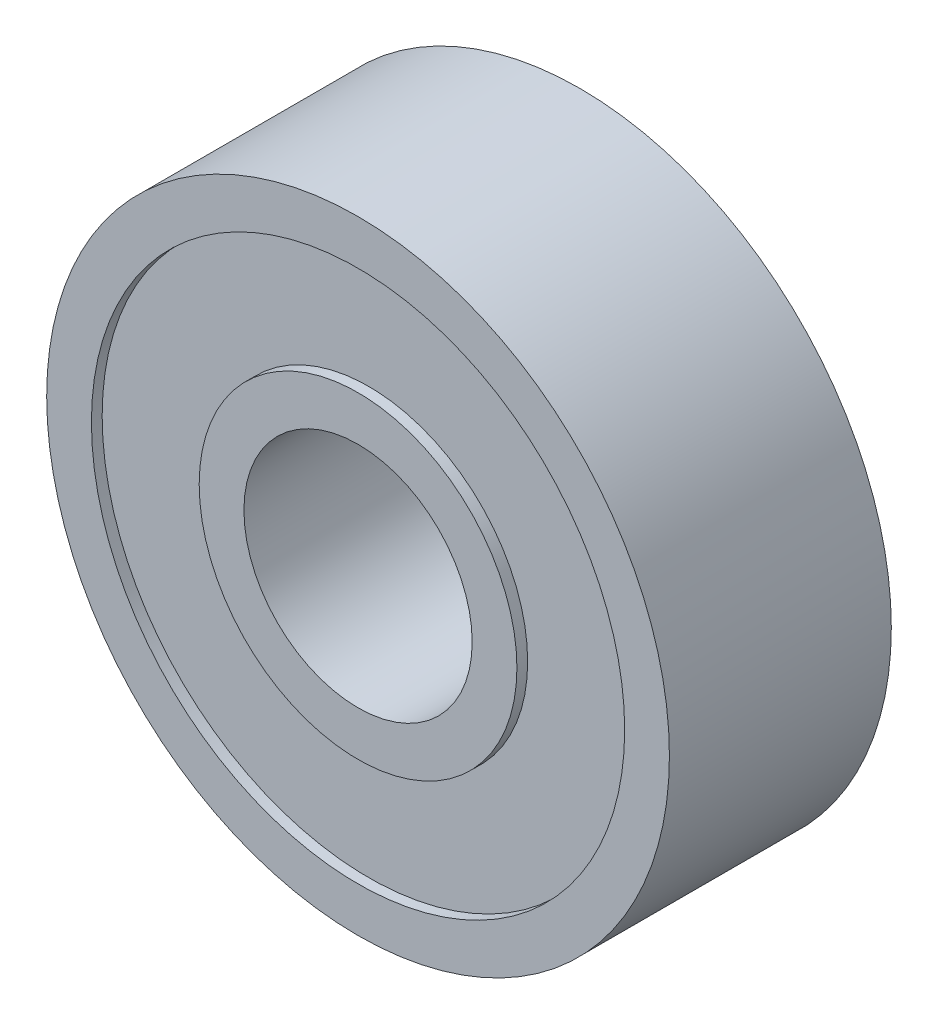
ISO-10303-21;
HEADER;
FILE_DESCRIPTION(('STEP AP214'),'2;1');
FILE_NAME('part.step','',(''),(''),'','','');
FILE_SCHEMA(('AUTOMOTIVE_DESIGN { 1 0 10303 214 1 1 1 1 }'));
ENDSEC;
DATA;
#1=APPLICATION_CONTEXT('core data for automotive mechanical design processes');
#2=APPLICATION_PROTOCOL_DEFINITION('international standard','automotive_design',2000,#1);
#3=PRODUCT_CONTEXT('',#1,'mechanical');
#4=PRODUCT('Part','Part','',(#3));
#5=PRODUCT_RELATED_PRODUCT_CATEGORY('part','',(#4));
#6=PRODUCT_DEFINITION_FORMATION('','',#4);
#7=PRODUCT_DEFINITION_CONTEXT('part definition',#1,'design');
#8=PRODUCT_DEFINITION('design','',#6,#7);
#9=PRODUCT_DEFINITION_SHAPE('','',#8);
#10=(LENGTH_UNIT() NAMED_UNIT(*) SI_UNIT(.MILLI.,.METRE.));
#11=(NAMED_UNIT(*) PLANE_ANGLE_UNIT() SI_UNIT($,.RADIAN.));
#12=(NAMED_UNIT(*) SI_UNIT($,.STERADIAN.) SOLID_ANGLE_UNIT());
#13=UNCERTAINTY_MEASURE_WITH_UNIT(LENGTH_MEASURE(1.E-05),#10,'distance_accuracy_value','');
#14=(GEOMETRIC_REPRESENTATION_CONTEXT(3) GLOBAL_UNCERTAINTY_ASSIGNED_CONTEXT((#13)) GLOBAL_UNIT_ASSIGNED_CONTEXT((#10,
#11,#12)) REPRESENTATION_CONTEXT('',''));
#15=CARTESIAN_POINT('',(0.,0.,0.));
#16=DIRECTION('',(0.,0.,1.));
#17=DIRECTION('',(1.,0.,0.));
#18=AXIS2_PLACEMENT_3D('',#15,#16,#17);
#19=CARTESIAN_POINT('',(0.,0.,-3.937));
#20=DIRECTION('',(0.,0.,1.));
#21=DIRECTION('',(1.,0.,0.));
#22=AXIS2_PLACEMENT_3D('',#19,#20,#21);
#23=PLANE('',#22);
#24=CARTESIAN_POINT('',(0.,0.,-3.937));
#25=DIRECTION('',(0.,0.,1.));
#26=DIRECTION('',(1.,0.,0.));
#27=AXIS2_PLACEMENT_3D('',#24,#25,#26);
#28=CIRCLE('',#27,4.05);
#29=CARTESIAN_POINT('',(4.05,0.,-3.937));
#30=VERTEX_POINT('',#29);
#31=EDGE_CURVE('E52',#30,#30,#28,.T.);
#32=ORIENTED_EDGE('',*,*,#31,.T.);
#33=EDGE_LOOP('',(#32));
#34=FACE_BOUND('',#33,.T.);
#35=CARTESIAN_POINT('',(0.,0.,-3.937));
#36=DIRECTION('',(0.,0.,1.));
#37=DIRECTION('',(1.,0.,0.));
#38=AXIS2_PLACEMENT_3D('',#35,#36,#37);
#39=CIRCLE('',#38,5.6375);
#40=CARTESIAN_POINT('',(5.6375,0.,-3.937));
#41=VERTEX_POINT('',#40);
#42=EDGE_CURVE('E76',#41,#41,#39,.T.);
#43=ORIENTED_EDGE('',*,*,#42,.F.);
#44=EDGE_LOOP('',(#43));
#45=FACE_BOUND('',#44,.T.);
#46=ADVANCED_FACE('F39',(#34,#45),#23,.F.);
#47=CARTESIAN_POINT('',(0.,0.,3.937));
#48=DIRECTION('',(0.,0.,1.));
#49=DIRECTION('',(1.,0.,0.));
#50=AXIS2_PLACEMENT_3D('',#47,#48,#49);
#51=PLANE('',#50);
#52=CARTESIAN_POINT('',(0.,0.,3.937));
#53=DIRECTION('',(0.,0.,1.));
#54=DIRECTION('',(1.,0.,0.));
#55=AXIS2_PLACEMENT_3D('',#52,#53,#54);
#56=CIRCLE('',#55,4.05);
#57=CARTESIAN_POINT('',(4.05,0.,3.937));
#58=VERTEX_POINT('',#57);
#59=EDGE_CURVE('E50',#58,#58,#56,.T.);
#60=ORIENTED_EDGE('',*,*,#59,.F.);
#61=EDGE_LOOP('',(#60));
#62=FACE_BOUND('',#61,.T.);
#63=CARTESIAN_POINT('',(0.,0.,3.937));
#64=DIRECTION('',(0.,0.,1.));
#65=DIRECTION('',(1.,0.,0.));
#66=AXIS2_PLACEMENT_3D('',#63,#64,#65);
#67=CIRCLE('',#66,5.6375);
#68=CARTESIAN_POINT('',(5.6375,0.,3.937));
#69=VERTEX_POINT('',#68);
#70=EDGE_CURVE('E64',#69,#69,#67,.T.);
#71=ORIENTED_EDGE('',*,*,#70,.T.);
#72=EDGE_LOOP('',(#71));
#73=FACE_BOUND('',#72,.T.);
#74=ADVANCED_FACE('F92',(#62,#73),#51,.T.);
#75=CARTESIAN_POINT('',(0.,0.,3.937));
#76=DIRECTION('',(0.,0.,1.));
#77=DIRECTION('',(1.,0.,0.));
#78=AXIS2_PLACEMENT_3D('',#75,#76,#77);
#79=CIRCLE('',#78,9.4615);
#80=CARTESIAN_POINT('',(9.4615,0.,3.937));
#81=VERTEX_POINT('',#80);
#82=EDGE_CURVE('E58',#81,#81,#79,.T.);
#83=ORIENTED_EDGE('',*,*,#82,.F.);
#84=EDGE_LOOP('',(#83));
#85=FACE_BOUND('',#84,.T.);
#86=CARTESIAN_POINT('',(0.,0.,3.937));
#87=DIRECTION('',(0.,0.,1.));
#88=DIRECTION('',(1.,0.,0.));
#89=AXIS2_PLACEMENT_3D('',#86,#87,#88);
#90=CIRCLE('',#89,11.049);
#91=CARTESIAN_POINT('',(11.049,0.,3.937));
#92=VERTEX_POINT('',#91);
#93=EDGE_CURVE('E10',#92,#92,#90,.T.);
#94=ORIENTED_EDGE('',*,*,#93,.T.);
#95=EDGE_LOOP('',(#94));
#96=FACE_BOUND('',#95,.T.);
#97=ADVANCED_FACE('F100',(#85,#96),#51,.T.);
#98=CARTESIAN_POINT('',(0.,0.,-3.937));
#99=DIRECTION('',(0.,0.,1.));
#100=DIRECTION('',(1.,0.,0.));
#101=AXIS2_PLACEMENT_3D('',#98,#99,#100);
#102=CIRCLE('',#101,9.4615);
#103=CARTESIAN_POINT('',(9.4615,0.,-3.937));
#104=VERTEX_POINT('',#103);
#105=EDGE_CURVE('E70',#104,#104,#102,.T.);
#106=ORIENTED_EDGE('',*,*,#105,.T.);
#107=EDGE_LOOP('',(#106));
#108=FACE_BOUND('',#107,.T.);
#109=CARTESIAN_POINT('',(0.,0.,-3.937));
#110=DIRECTION('',(0.,0.,1.));
#111=DIRECTION('',(1.,0.,0.));
#112=AXIS2_PLACEMENT_3D('',#109,#110,#111);
#113=CIRCLE('',#112,11.049);
#114=CARTESIAN_POINT('',(11.049,0.,-3.937));
#115=VERTEX_POINT('',#114);
#116=EDGE_CURVE('E43',#115,#115,#113,.T.);
#117=ORIENTED_EDGE('',*,*,#116,.F.);
#118=EDGE_LOOP('',(#117));
#119=FACE_BOUND('',#118,.T.);
#120=ADVANCED_FACE('F94',(#108,#119),#23,.F.);
#121=CARTESIAN_POINT('',(0.,0.,3.937));
#122=DIRECTION('',(0.,0.,-1.));
#123=DIRECTION('',(-1.,0.,0.));
#124=AXIS2_PLACEMENT_3D('',#121,#122,#123);
#125=CYLINDRICAL_SURFACE('',#124,11.049);
#126=ORIENTED_EDGE('',*,*,#93,.F.);
#127=EDGE_LOOP('',(#126));
#128=FACE_BOUND('',#127,.T.);
#129=ORIENTED_EDGE('',*,*,#116,.T.);
#130=EDGE_LOOP('',(#129));
#131=FACE_BOUND('',#130,.T.);
#132=ADVANCED_FACE('F41',(#128,#131),#125,.T.);
#133=CARTESIAN_POINT('',(0.,0.,3.937));
#134=DIRECTION('',(0.,0.,-1.));
#135=DIRECTION('',(-1.,0.,0.));
#136=AXIS2_PLACEMENT_3D('',#133,#134,#135);
#137=CYLINDRICAL_SURFACE('',#136,4.05);
#138=ORIENTED_EDGE('',*,*,#59,.T.);
#139=EDGE_LOOP('',(#138));
#140=FACE_BOUND('',#139,.T.);
#141=ORIENTED_EDGE('',*,*,#31,.F.);
#142=EDGE_LOOP('',(#141));
#143=FACE_BOUND('',#142,.T.);
#144=ADVANCED_FACE('F108',(#140,#143),#137,.F.);
#145=CARTESIAN_POINT('',(0.,0.,3.556));
#146=DIRECTION('',(0.,0.,1.));
#147=DIRECTION('',(1.,0.,0.));
#148=AXIS2_PLACEMENT_3D('',#145,#146,#147);
#149=CYLINDRICAL_SURFACE('',#148,9.4615);
#150=CARTESIAN_POINT('',(0.,0.,3.556));
#151=DIRECTION('',(0.,0.,1.));
#152=DIRECTION('',(1.,0.,0.));
#153=AXIS2_PLACEMENT_3D('',#150,#151,#152);
#154=CIRCLE('',#153,9.4615);
#155=CARTESIAN_POINT('',(9.4615,0.,3.556));
#156=VERTEX_POINT('',#155);
#157=EDGE_CURVE('E55',#156,#156,#154,.T.);
#158=ORIENTED_EDGE('',*,*,#157,.F.);
#159=EDGE_LOOP('',(#158));
#160=FACE_BOUND('',#159,.T.);
#161=ORIENTED_EDGE('',*,*,#82,.T.);
#162=EDGE_LOOP('',(#161));
#163=FACE_BOUND('',#162,.T.);
#164=ADVANCED_FACE('F131',(#160,#163),#149,.F.);
#165=CARTESIAN_POINT('',(0.,0.,3.556));
#166=DIRECTION('',(0.,0.,1.));
#167=DIRECTION('',(1.,0.,0.));
#168=AXIS2_PLACEMENT_3D('',#165,#166,#167);
#169=PLANE('',#168);
#170=CARTESIAN_POINT('',(0.,0.,3.556));
#171=DIRECTION('',(0.,0.,1.));
#172=DIRECTION('',(1.,0.,0.));
#173=AXIS2_PLACEMENT_3D('',#170,#171,#172);
#174=CIRCLE('',#173,5.6375);
#175=CARTESIAN_POINT('',(5.6375,0.,3.556));
#176=VERTEX_POINT('',#175);
#177=EDGE_CURVE('E61',#176,#176,#174,.T.);
#178=ORIENTED_EDGE('',*,*,#177,.F.);
#179=EDGE_LOOP('',(#178));
#180=FACE_BOUND('',#179,.T.);
#181=ORIENTED_EDGE('',*,*,#157,.T.);
#182=EDGE_LOOP('',(#181));
#183=FACE_BOUND('',#182,.T.);
#184=ADVANCED_FACE('F127',(#180,#183),#169,.T.);
#185=CARTESIAN_POINT('',(0.,0.,3.556));
#186=DIRECTION('',(0.,0.,1.));
#187=DIRECTION('',(1.,0.,0.));
#188=AXIS2_PLACEMENT_3D('',#185,#186,#187);
#189=CYLINDRICAL_SURFACE('',#188,5.6375);
#190=ORIENTED_EDGE('',*,*,#177,.T.);
#191=EDGE_LOOP('',(#190));
#192=FACE_BOUND('',#191,.T.);
#193=ORIENTED_EDGE('',*,*,#70,.F.);
#194=EDGE_LOOP('',(#193));
#195=FACE_BOUND('',#194,.T.);
#196=ADVANCED_FACE('F122',(#192,#195),#189,.T.);
#197=CARTESIAN_POINT('',(0.,0.,-3.556));
#198=DIRECTION('',(0.,0.,-1.));
#199=DIRECTION('',(1.,0.,0.));
#200=AXIS2_PLACEMENT_3D('',#197,#198,#199);
#201=PLANE('',#200);
#202=CARTESIAN_POINT('',(0.,0.,-3.556));
#203=DIRECTION('',(0.,0.,1.));
#204=DIRECTION('',(1.,0.,0.));
#205=AXIS2_PLACEMENT_3D('',#202,#203,#204);
#206=CIRCLE('',#205,9.4615);
#207=CARTESIAN_POINT('',(9.4615,0.,-3.556));
#208=VERTEX_POINT('',#207);
#209=EDGE_CURVE('E67',#208,#208,#206,.T.);
#210=ORIENTED_EDGE('',*,*,#209,.F.);
#211=EDGE_LOOP('',(#210));
#212=FACE_BOUND('',#211,.T.);
#213=CARTESIAN_POINT('',(0.,0.,-3.556));
#214=DIRECTION('',(0.,0.,1.));
#215=DIRECTION('',(1.,0.,0.));
#216=AXIS2_PLACEMENT_3D('',#213,#214,#215);
#217=CIRCLE('',#216,5.6375);
#218=CARTESIAN_POINT('',(5.6375,0.,-3.556));
#219=VERTEX_POINT('',#218);
#220=EDGE_CURVE('E73',#219,#219,#217,.T.);
#221=ORIENTED_EDGE('',*,*,#220,.T.);
#222=EDGE_LOOP('',(#221));
#223=FACE_BOUND('',#222,.T.);
#224=ADVANCED_FACE('F82',(#212,#223),#201,.T.);
#225=CARTESIAN_POINT('',(0.,0.,-3.556));
#226=DIRECTION('',(0.,0.,-1.));
#227=DIRECTION('',(-1.,0.,0.));
#228=AXIS2_PLACEMENT_3D('',#225,#226,#227);
#229=CYLINDRICAL_SURFACE('',#228,9.4615);
#230=ORIENTED_EDGE('',*,*,#209,.T.);
#231=EDGE_LOOP('',(#230));
#232=FACE_BOUND('',#231,.T.);
#233=ORIENTED_EDGE('',*,*,#105,.F.);
#234=EDGE_LOOP('',(#233));
#235=FACE_BOUND('',#234,.T.);
#236=ADVANCED_FACE('F87',(#232,#235),#229,.F.);
#237=CARTESIAN_POINT('',(0.,0.,-3.556));
#238=DIRECTION('',(0.,0.,-1.));
#239=DIRECTION('',(-1.,0.,0.));
#240=AXIS2_PLACEMENT_3D('',#237,#238,#239);
#241=CYLINDRICAL_SURFACE('',#240,5.6375);
#242=ORIENTED_EDGE('',*,*,#220,.F.);
#243=EDGE_LOOP('',(#242));
#244=FACE_BOUND('',#243,.T.);
#245=ORIENTED_EDGE('',*,*,#42,.T.);
#246=EDGE_LOOP('',(#245));
#247=FACE_BOUND('',#246,.T.);
#248=ADVANCED_FACE('F84',(#244,#247),#241,.T.);
#249=CLOSED_SHELL('',(#46,#74,#97,#120,#132,#144,#164,#184,#196,#224,#236,#248));
#250=MANIFOLD_SOLID_BREP('B2',#249);
#251=ADVANCED_BREP_SHAPE_REPRESENTATION('',(#18,#250),#14);
#252=SHAPE_DEFINITION_REPRESENTATION(#9,#251);
ENDSEC;
END-ISO-10303-21;
